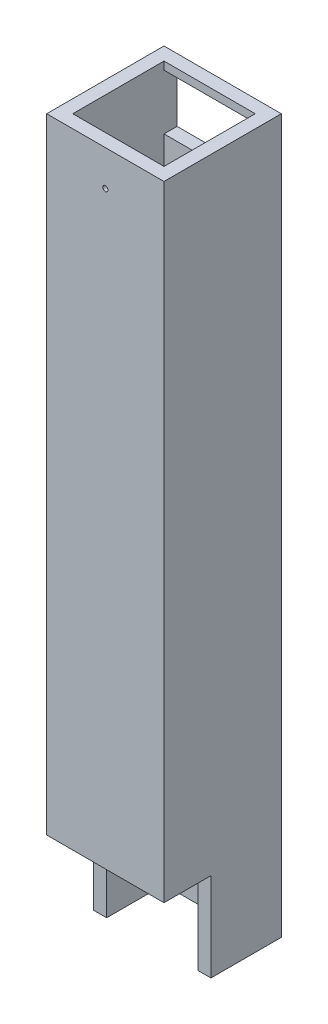
ISO-10303-21;
HEADER;
FILE_DESCRIPTION(('STEP AP214'),'2;1');
FILE_NAME('part.step','',(''),(''),'','','');
FILE_SCHEMA(('AUTOMOTIVE_DESIGN { 1 0 10303 214 1 1 1 1 }'));
ENDSEC;
DATA;
#1=APPLICATION_CONTEXT('core data for automotive mechanical design processes');
#2=APPLICATION_PROTOCOL_DEFINITION('international standard','automotive_design',2000,#1);
#3=PRODUCT_CONTEXT('',#1,'mechanical');
#4=PRODUCT('Part','Part','',(#3));
#5=PRODUCT_RELATED_PRODUCT_CATEGORY('part','',(#4));
#6=PRODUCT_DEFINITION_FORMATION('','',#4);
#7=PRODUCT_DEFINITION_CONTEXT('part definition',#1,'design');
#8=PRODUCT_DEFINITION('design','',#6,#7);
#9=PRODUCT_DEFINITION_SHAPE('','',#8);
#10=(LENGTH_UNIT() NAMED_UNIT(*) SI_UNIT(.MILLI.,.METRE.));
#11=(NAMED_UNIT(*) PLANE_ANGLE_UNIT() SI_UNIT($,.RADIAN.));
#12=(NAMED_UNIT(*) SI_UNIT($,.STERADIAN.) SOLID_ANGLE_UNIT());
#13=UNCERTAINTY_MEASURE_WITH_UNIT(LENGTH_MEASURE(1.E-05),#10,'distance_accuracy_value','');
#14=(GEOMETRIC_REPRESENTATION_CONTEXT(3) GLOBAL_UNCERTAINTY_ASSIGNED_CONTEXT((#13)) GLOBAL_UNIT_ASSIGNED_CONTEXT((#10,
#11,#12)) REPRESENTATION_CONTEXT('',''));
#15=CARTESIAN_POINT('',(0.,0.,0.));
#16=DIRECTION('',(0.,0.,1.));
#17=DIRECTION('',(1.,0.,0.));
#18=AXIS2_PLACEMENT_3D('',#15,#16,#17);
#19=CARTESIAN_POINT('',(-17.5,0.,-17.5));
#20=DIRECTION('',(0.,0.,1.));
#21=DIRECTION('',(1.,0.,0.));
#22=AXIS2_PLACEMENT_3D('',#19,#20,#21);
#23=PLANE('',#22);
#24=DIRECTION('',(1.,0.,0.));
#25=VECTOR('',#24,1.);
#26=CARTESIAN_POINT('',(-17.5,273.612120728358,-17.5));
#27=LINE('',#26,#25);
#28=CARTESIAN_POINT('',(-17.5,273.612120728358,-17.5));
#29=VERTEX_POINT('',#28);
#30=CARTESIAN_POINT('',(17.5,273.612120728358,-17.5));
#31=VERTEX_POINT('',#30);
#32=EDGE_CURVE('E198',#29,#31,#27,.T.);
#33=ORIENTED_EDGE('',*,*,#32,.F.);
#34=DIRECTION('',(0.,1.,0.));
#35=VECTOR('',#34,1.);
#36=CARTESIAN_POINT('',(-17.5,0.,-17.5));
#37=LINE('',#36,#35);
#38=CARTESIAN_POINT('',(-17.5,270.587205010945,-17.5));
#39=VERTEX_POINT('',#38);
#40=EDGE_CURVE('E240',#39,#29,#37,.T.);
#41=ORIENTED_EDGE('',*,*,#40,.F.);
#42=DIRECTION('',(1.,0.,0.));
#43=VECTOR('',#42,1.);
#44=CARTESIAN_POINT('',(-17.5,270.587205010945,-17.5));
#45=LINE('',#44,#43);
#46=CARTESIAN_POINT('',(17.5,270.587205010945,-17.5));
#47=VERTEX_POINT('',#46);
#48=EDGE_CURVE('E186',#39,#47,#45,.T.);
#49=ORIENTED_EDGE('',*,*,#48,.T.);
#50=DIRECTION('',(0.,1.,0.));
#51=VECTOR('',#50,1.);
#52=CARTESIAN_POINT('',(17.5,0.,-17.5));
#53=LINE('',#52,#51);
#54=EDGE_CURVE('E236',#47,#31,#53,.T.);
#55=ORIENTED_EDGE('',*,*,#54,.T.);
#56=EDGE_LOOP('',(#33,#41,#49,#55));
#57=FACE_BOUND('',#56,.T.);
#58=ADVANCED_FACE('F39',(#57),#23,.T.);
#59=CARTESIAN_POINT('',(0.,0.,0.));
#60=DIRECTION('',(0.,-1.,0.));
#61=DIRECTION('',(0.,0.,-1.));
#62=AXIS2_PLACEMENT_3D('',#59,#60,#61);
#63=PLANE('',#62);
#64=DIRECTION('',(1.,0.,0.));
#65=VECTOR('',#64,1.);
#66=CARTESIAN_POINT('',(-17.5,0.,-17.5));
#67=LINE('',#66,#65);
#68=CARTESIAN_POINT('',(-17.5,0.,-17.5));
#69=VERTEX_POINT('',#68);
#70=CARTESIAN_POINT('',(17.5,0.,-17.5));
#71=VERTEX_POINT('',#70);
#72=EDGE_CURVE('E225',#69,#71,#67,.T.);
#73=ORIENTED_EDGE('',*,*,#72,.F.);
#74=DIRECTION('',(0.,0.,-1.));
#75=VECTOR('',#74,1.);
#76=CARTESIAN_POINT('',(-17.5,0.,17.5));
#77=LINE('',#76,#75);
#78=CARTESIAN_POINT('',(-17.5,0.,4.5));
#79=VERTEX_POINT('',#78);
#80=EDGE_CURVE('E217',#79,#69,#77,.T.);
#81=ORIENTED_EDGE('',*,*,#80,.F.);
#82=DIRECTION('',(-1.,0.,0.));
#83=VECTOR('',#82,1.);
#84=CARTESIAN_POINT('',(22.5,0.,4.5));
#85=LINE('',#84,#83);
#86=CARTESIAN_POINT('',(-22.5,0.,4.50000000000001));
#87=VERTEX_POINT('',#86);
#88=EDGE_CURVE('E266',#79,#87,#85,.T.);
#89=ORIENTED_EDGE('',*,*,#88,.T.);
#90=DIRECTION('',(0.,0.,1.));
#91=VECTOR('',#90,1.);
#92=CARTESIAN_POINT('',(-22.5,0.,22.5));
#93=LINE('',#92,#91);
#94=CARTESIAN_POINT('',(-22.5,0.,-22.5));
#95=VERTEX_POINT('',#94);
#96=EDGE_CURVE('E276',#95,#87,#93,.T.);
#97=ORIENTED_EDGE('',*,*,#96,.F.);
#98=DIRECTION('',(-1.,0.,0.));
#99=VECTOR('',#98,1.);
#100=CARTESIAN_POINT('',(-22.5,0.,-22.5));
#101=LINE('',#100,#99);
#102=CARTESIAN_POINT('',(22.5,0.,-22.5));
#103=VERTEX_POINT('',#102);
#104=EDGE_CURVE('E169',#103,#95,#101,.T.);
#105=ORIENTED_EDGE('',*,*,#104,.F.);
#106=DIRECTION('',(0.,0.,-1.));
#107=VECTOR('',#106,1.);
#108=CARTESIAN_POINT('',(22.5,0.,22.5));
#109=LINE('',#108,#107);
#110=CARTESIAN_POINT('',(22.5,0.,4.5));
#111=VERTEX_POINT('',#110);
#112=EDGE_CURVE('E265',#111,#103,#109,.T.);
#113=ORIENTED_EDGE('',*,*,#112,.F.);
#114=CARTESIAN_POINT('',(17.5,0.,4.5));
#115=VERTEX_POINT('',#114);
#116=EDGE_CURVE('E262',#111,#115,#85,.T.);
#117=ORIENTED_EDGE('',*,*,#116,.T.);
#118=DIRECTION('',(0.,0.,-1.));
#119=VECTOR('',#118,1.);
#120=CARTESIAN_POINT('',(17.5,0.,17.5));
#121=LINE('',#120,#119);
#122=EDGE_CURVE('E227',#115,#71,#121,.T.);
#123=ORIENTED_EDGE('',*,*,#122,.T.);
#124=EDGE_LOOP('',(#73,#81,#89,#97,#105,#113,#117,#123));
#125=FACE_BOUND('',#124,.T.);
#126=ADVANCED_FACE('F321',(#125),#63,.T.);
#127=CARTESIAN_POINT('',(22.5,0.,4.5));
#128=DIRECTION('',(0.,0.,-1.));
#129=DIRECTION('',(-1.,0.,0.));
#130=AXIS2_PLACEMENT_3D('',#127,#128,#129);
#131=PLANE('',#130);
#132=DIRECTION('',(0.,-1.,0.));
#133=VECTOR('',#132,1.);
#134=CARTESIAN_POINT('',(-17.5,0.,4.5));
#135=LINE('',#134,#133);
#136=CARTESIAN_POINT('',(-17.5,34.,4.5));
#137=VERTEX_POINT('',#136);
#138=EDGE_CURVE('E247',#137,#79,#135,.T.);
#139=ORIENTED_EDGE('',*,*,#138,.F.);
#140=DIRECTION('',(-1.,0.,0.));
#141=VECTOR('',#140,1.);
#142=CARTESIAN_POINT('',(22.5,34.,4.5));
#143=LINE('',#142,#141);
#144=CARTESIAN_POINT('',(-22.5,34.,4.5));
#145=VERTEX_POINT('',#144);
#146=EDGE_CURVE('E270',#137,#145,#143,.T.);
#147=ORIENTED_EDGE('',*,*,#146,.T.);
#148=DIRECTION('',(0.,-1.,0.));
#149=VECTOR('',#148,1.);
#150=CARTESIAN_POINT('',(-22.5,0.,4.5));
#151=LINE('',#150,#149);
#152=EDGE_CURVE('E254',#145,#87,#151,.T.);
#153=ORIENTED_EDGE('',*,*,#152,.T.);
#154=ORIENTED_EDGE('',*,*,#88,.F.);
#155=EDGE_LOOP('',(#139,#147,#153,#154));
#156=FACE_BOUND('',#155,.T.);
#157=ADVANCED_FACE('F315',(#156),#131,.F.);
#158=CARTESIAN_POINT('',(22.5,34.,4.5));
#159=DIRECTION('',(0.,1.,0.));
#160=DIRECTION('',(0.,0.,1.));
#161=AXIS2_PLACEMENT_3D('',#158,#159,#160);
#162=PLANE('',#161);
#163=DIRECTION('',(0.,0.,-1.));
#164=VECTOR('',#163,1.);
#165=CARTESIAN_POINT('',(-17.5,34.,4.5));
#166=LINE('',#165,#164);
#167=CARTESIAN_POINT('',(-17.5,34.,17.5));
#168=VERTEX_POINT('',#167);
#169=EDGE_CURVE('E184',#168,#137,#166,.T.);
#170=ORIENTED_EDGE('',*,*,#169,.F.);
#171=DIRECTION('',(1.,0.,0.));
#172=VECTOR('',#171,1.);
#173=CARTESIAN_POINT('',(22.5,34.,17.5));
#174=LINE('',#173,#172);
#175=CARTESIAN_POINT('',(17.5,34.,17.5));
#176=VERTEX_POINT('',#175);
#177=EDGE_CURVE('E173',#168,#176,#174,.T.);
#178=ORIENTED_EDGE('',*,*,#177,.T.);
#179=DIRECTION('',(0.,0.,-1.));
#180=VECTOR('',#179,1.);
#181=CARTESIAN_POINT('',(17.5,34.,4.5));
#182=LINE('',#181,#180);
#183=CARTESIAN_POINT('',(17.5,34.,4.5));
#184=VERTEX_POINT('',#183);
#185=EDGE_CURVE('E181',#176,#184,#182,.T.);
#186=ORIENTED_EDGE('',*,*,#185,.T.);
#187=CARTESIAN_POINT('',(22.5,34.,4.5));
#188=VERTEX_POINT('',#187);
#189=EDGE_CURVE('E267',#188,#184,#143,.T.);
#190=ORIENTED_EDGE('',*,*,#189,.F.);
#191=DIRECTION('',(0.,0.,-1.));
#192=VECTOR('',#191,1.);
#193=CARTESIAN_POINT('',(22.5,34.,4.5));
#194=LINE('',#193,#192);
#195=CARTESIAN_POINT('',(22.5,34.,22.5));
#196=VERTEX_POINT('',#195);
#197=EDGE_CURVE('E250',#196,#188,#194,.T.);
#198=ORIENTED_EDGE('',*,*,#197,.F.);
#199=DIRECTION('',(-1.,0.,0.));
#200=VECTOR('',#199,1.);
#201=CARTESIAN_POINT('',(22.5,34.,22.5));
#202=LINE('',#201,#200);
#203=CARTESIAN_POINT('',(-22.5,34.,22.5));
#204=VERTEX_POINT('',#203);
#205=EDGE_CURVE('E257',#196,#204,#202,.T.);
#206=ORIENTED_EDGE('',*,*,#205,.T.);
#207=DIRECTION('',(0.,0.,-1.));
#208=VECTOR('',#207,1.);
#209=CARTESIAN_POINT('',(-22.5,34.,4.5));
#210=LINE('',#209,#208);
#211=EDGE_CURVE('E249',#204,#145,#210,.T.);
#212=ORIENTED_EDGE('',*,*,#211,.T.);
#213=ORIENTED_EDGE('',*,*,#146,.F.);
#214=EDGE_LOOP('',(#170,#178,#186,#190,#198,#206,#212,#213));
#215=FACE_BOUND('',#214,.T.);
#216=ADVANCED_FACE('F284',(#215),#162,.F.);
#217=CARTESIAN_POINT('',(22.5,300.,22.5));
#218=DIRECTION('',(-1.,0.,0.));
#219=DIRECTION('',(0.,0.,1.));
#220=AXIS2_PLACEMENT_3D('',#217,#218,#219);
#221=PLANE('',#220);
#222=DIRECTION('',(0.,-1.,0.));
#223=VECTOR('',#222,1.);
#224=CARTESIAN_POINT('',(22.5,300.,-22.5));
#225=LINE('',#224,#223);
#226=CARTESIAN_POINT('',(22.5,273.612120728358,-22.5));
#227=VERTEX_POINT('',#226);
#228=EDGE_CURVE('E171',#227,#103,#225,.T.);
#229=ORIENTED_EDGE('',*,*,#228,.F.);
#230=DIRECTION('',(0.,0.,1.));
#231=VECTOR('',#230,1.);
#232=CARTESIAN_POINT('',(22.5,273.612120728358,-22.5));
#233=LINE('',#232,#231);
#234=CARTESIAN_POINT('',(22.5,273.612120728358,22.5));
#235=VERTEX_POINT('',#234);
#236=EDGE_CURVE('E152',#227,#235,#233,.T.);
#237=ORIENTED_EDGE('',*,*,#236,.T.);
#238=DIRECTION('',(0.,-1.,0.));
#239=VECTOR('',#238,1.);
#240=CARTESIAN_POINT('',(22.5,300.,22.5));
#241=LINE('',#240,#239);
#242=EDGE_CURVE('E175',#235,#196,#241,.T.);
#243=ORIENTED_EDGE('',*,*,#242,.T.);
#244=ORIENTED_EDGE('',*,*,#197,.T.);
#245=DIRECTION('',(0.,-1.,0.));
#246=VECTOR('',#245,1.);
#247=CARTESIAN_POINT('',(22.5,0.,4.5));
#248=LINE('',#247,#246);
#249=EDGE_CURVE('E253',#188,#111,#248,.T.);
#250=ORIENTED_EDGE('',*,*,#249,.T.);
#251=ORIENTED_EDGE('',*,*,#112,.T.);
#252=EDGE_LOOP('',(#229,#237,#243,#244,#250,#251));
#253=FACE_BOUND('',#252,.T.);
#254=ADVANCED_FACE('F41',(#253),#221,.F.);
#255=CARTESIAN_POINT('',(-22.5,300.,-22.5));
#256=DIRECTION('',(0.,0.,1.));
#257=DIRECTION('',(1.,0.,0.));
#258=AXIS2_PLACEMENT_3D('',#255,#256,#257);
#259=PLANE('',#258);
#260=DIRECTION('',(0.,1.,0.));
#261=VECTOR('',#260,1.);
#262=CARTESIAN_POINT('',(-17.5,249.412794989055,-22.5));
#263=LINE('',#262,#261);
#264=CARTESIAN_POINT('',(-17.5,249.412794989055,-22.5));
#265=VERTEX_POINT('',#264);
#266=CARTESIAN_POINT('',(-17.5,270.587205010945,-22.5));
#267=VERTEX_POINT('',#266);
#268=EDGE_CURVE('E195',#265,#267,#263,.T.);
#269=ORIENTED_EDGE('',*,*,#268,.F.);
#270=DIRECTION('',(-1.,0.,0.));
#271=VECTOR('',#270,1.);
#272=CARTESIAN_POINT('',(17.5,249.412794989055,-22.5));
#273=LINE('',#272,#271);
#274=CARTESIAN_POINT('',(17.5,249.412794989055,-22.5));
#275=VERTEX_POINT('',#274);
#276=EDGE_CURVE('E191',#275,#265,#273,.T.);
#277=ORIENTED_EDGE('',*,*,#276,.F.);
#278=DIRECTION('',(0.,1.,0.));
#279=VECTOR('',#278,1.);
#280=CARTESIAN_POINT('',(17.5,249.412794989055,-22.5));
#281=LINE('',#280,#279);
#282=CARTESIAN_POINT('',(17.5,270.587205010945,-22.5));
#283=VERTEX_POINT('',#282);
#284=EDGE_CURVE('E211',#275,#283,#281,.T.);
#285=ORIENTED_EDGE('',*,*,#284,.T.);
#286=DIRECTION('',(-1.,0.,0.));
#287=VECTOR('',#286,1.);
#288=CARTESIAN_POINT('',(17.5,270.587205010945,-22.5));
#289=LINE('',#288,#287);
#290=EDGE_CURVE('E208',#283,#267,#289,.T.);
#291=ORIENTED_EDGE('',*,*,#290,.T.);
#292=EDGE_LOOP('',(#269,#277,#285,#291));
#293=FACE_BOUND('',#292,.T.);
#294=DIRECTION('',(0.,-1.,0.));
#295=VECTOR('',#294,1.);
#296=CARTESIAN_POINT('',(-22.5,300.,-22.5));
#297=LINE('',#296,#295);
#298=CARTESIAN_POINT('',(-22.5,273.612120728358,-22.5));
#299=VERTEX_POINT('',#298);
#300=EDGE_CURVE('E162',#299,#95,#297,.T.);
#301=ORIENTED_EDGE('',*,*,#300,.F.);
#302=DIRECTION('',(1.,0.,0.));
#303=VECTOR('',#302,1.);
#304=CARTESIAN_POINT('',(-22.5,273.612120728358,-22.5));
#305=LINE('',#304,#303);
#306=EDGE_CURVE('E149',#299,#227,#305,.T.);
#307=ORIENTED_EDGE('',*,*,#306,.T.);
#308=ORIENTED_EDGE('',*,*,#228,.T.);
#309=ORIENTED_EDGE('',*,*,#104,.T.);
#310=EDGE_LOOP('',(#301,#307,#308,#309));
#311=FACE_BOUND('',#310,.T.);
#312=ADVANCED_FACE('F167',(#293,#311),#259,.F.);
#313=CARTESIAN_POINT('',(-22.5,300.,22.5));
#314=DIRECTION('',(1.,0.,0.));
#315=DIRECTION('',(0.,0.,-1.));
#316=AXIS2_PLACEMENT_3D('',#313,#314,#315);
#317=PLANE('',#316);
#318=DIRECTION('',(0.,-1.,0.));
#319=VECTOR('',#318,1.);
#320=CARTESIAN_POINT('',(-22.5,300.,22.5));
#321=LINE('',#320,#319);
#322=CARTESIAN_POINT('',(-22.5,273.612120728358,22.5));
#323=VERTEX_POINT('',#322);
#324=EDGE_CURVE('E165',#323,#204,#321,.T.);
#325=ORIENTED_EDGE('',*,*,#324,.F.);
#326=DIRECTION('',(0.,0.,1.));
#327=VECTOR('',#326,1.);
#328=CARTESIAN_POINT('',(-22.5,273.612120728358,-22.5));
#329=LINE('',#328,#327);
#330=EDGE_CURVE('E54',#299,#323,#329,.T.);
#331=ORIENTED_EDGE('',*,*,#330,.F.);
#332=ORIENTED_EDGE('',*,*,#300,.T.);
#333=ORIENTED_EDGE('',*,*,#96,.T.);
#334=ORIENTED_EDGE('',*,*,#152,.F.);
#335=ORIENTED_EDGE('',*,*,#211,.F.);
#336=EDGE_LOOP('',(#325,#331,#332,#333,#334,#335));
#337=FACE_BOUND('',#336,.T.);
#338=ADVANCED_FACE('F160',(#337),#317,.F.);
#339=CARTESIAN_POINT('',(-22.5,300.,22.5));
#340=DIRECTION('',(0.,0.,-1.));
#341=DIRECTION('',(-1.,0.,0.));
#342=AXIS2_PLACEMENT_3D('',#339,#340,#341);
#343=PLANE('',#342);
#344=CARTESIAN_POINT('',(0.,260.,22.5));
#345=DIRECTION('',(0.,0.,1.));
#346=DIRECTION('',(1.,0.,0.));
#347=AXIS2_PLACEMENT_3D('',#344,#345,#346);
#348=CIRCLE('',#347,1.);
#349=CARTESIAN_POINT('',(1.,260.,22.5));
#350=VERTEX_POINT('',#349);
#351=EDGE_CURVE('E192',#350,#350,#348,.T.);
#352=ORIENTED_EDGE('',*,*,#351,.F.);
#353=EDGE_LOOP('',(#352));
#354=FACE_BOUND('',#353,.T.);
#355=ORIENTED_EDGE('',*,*,#242,.F.);
#356=DIRECTION('',(1.,0.,0.));
#357=VECTOR('',#356,1.);
#358=CARTESIAN_POINT('',(-22.5,273.612120728358,22.5));
#359=LINE('',#358,#357);
#360=EDGE_CURVE('E156',#323,#235,#359,.T.);
#361=ORIENTED_EDGE('',*,*,#360,.F.);
#362=ORIENTED_EDGE('',*,*,#324,.T.);
#363=ORIENTED_EDGE('',*,*,#205,.F.);
#364=EDGE_LOOP('',(#355,#361,#362,#363));
#365=FACE_BOUND('',#364,.T.);
#366=ADVANCED_FACE('F286',(#354,#365),#343,.F.);
#367=ORIENTED_EDGE('',*,*,#189,.T.);
#368=DIRECTION('',(0.,-1.,0.));
#369=VECTOR('',#368,1.);
#370=CARTESIAN_POINT('',(17.5,0.,4.5));
#371=LINE('',#370,#369);
#372=EDGE_CURVE('E244',#184,#115,#371,.T.);
#373=ORIENTED_EDGE('',*,*,#372,.T.);
#374=ORIENTED_EDGE('',*,*,#116,.F.);
#375=ORIENTED_EDGE('',*,*,#249,.F.);
#376=EDGE_LOOP('',(#367,#373,#374,#375));
#377=FACE_BOUND('',#376,.T.);
#378=ADVANCED_FACE('F390',(#377),#131,.F.);
#379=CARTESIAN_POINT('',(-17.5,0.,17.5));
#380=DIRECTION('',(1.,0.,0.));
#381=DIRECTION('',(0.,0.,-1.));
#382=AXIS2_PLACEMENT_3D('',#379,#380,#381);
#383=PLANE('',#382);
#384=DIRECTION('',(0.,0.,-1.));
#385=VECTOR('',#384,1.);
#386=CARTESIAN_POINT('',(-17.5,273.612120728358,17.5));
#387=LINE('',#386,#385);
#388=CARTESIAN_POINT('',(-17.5,273.612120728358,17.5));
#389=VERTEX_POINT('',#388);
#390=EDGE_CURVE('E202',#389,#29,#387,.T.);
#391=ORIENTED_EDGE('',*,*,#390,.F.);
#392=DIRECTION('',(0.,1.,0.));
#393=VECTOR('',#392,1.);
#394=CARTESIAN_POINT('',(-17.5,0.,17.5));
#395=LINE('',#394,#393);
#396=EDGE_CURVE('E230',#168,#389,#395,.T.);
#397=ORIENTED_EDGE('',*,*,#396,.F.);
#398=ORIENTED_EDGE('',*,*,#169,.T.);
#399=ORIENTED_EDGE('',*,*,#138,.T.);
#400=ORIENTED_EDGE('',*,*,#80,.T.);
#401=CARTESIAN_POINT('',(-17.5,249.412794989055,-17.5));
#402=VERTEX_POINT('',#401);
#403=EDGE_CURVE('E241',#69,#402,#37,.T.);
#404=ORIENTED_EDGE('',*,*,#403,.T.);
#405=DIRECTION('',(0.,0.,-1.));
#406=VECTOR('',#405,1.);
#407=CARTESIAN_POINT('',(-17.5,249.412794989055,-12.5));
#408=LINE('',#407,#406);
#409=EDGE_CURVE('E214',#402,#265,#408,.T.);
#410=ORIENTED_EDGE('',*,*,#409,.T.);
#411=ORIENTED_EDGE('',*,*,#268,.T.);
#412=DIRECTION('',(0.,0.,-1.));
#413=VECTOR('',#412,1.);
#414=CARTESIAN_POINT('',(-17.5,270.587205010945,-12.5));
#415=LINE('',#414,#413);
#416=EDGE_CURVE('E220',#39,#267,#415,.T.);
#417=ORIENTED_EDGE('',*,*,#416,.F.);
#418=ORIENTED_EDGE('',*,*,#40,.T.);
#419=EDGE_LOOP('',(#391,#397,#398,#399,#400,#404,#410,#411,#417,#418));
#420=FACE_BOUND('',#419,.T.);
#421=ADVANCED_FACE('F299',(#420),#383,.T.);
#422=CARTESIAN_POINT('',(17.5,0.,17.5));
#423=DIRECTION('',(1.,0.,0.));
#424=DIRECTION('',(0.,0.,-1.));
#425=AXIS2_PLACEMENT_3D('',#422,#423,#424);
#426=PLANE('',#425);
#427=DIRECTION('',(0.,1.,0.));
#428=VECTOR('',#427,1.);
#429=CARTESIAN_POINT('',(17.5,0.,17.5));
#430=LINE('',#429,#428);
#431=CARTESIAN_POINT('',(17.5,273.612120728358,17.5));
#432=VERTEX_POINT('',#431);
#433=EDGE_CURVE('E233',#176,#432,#430,.T.);
#434=ORIENTED_EDGE('',*,*,#433,.T.);
#435=DIRECTION('',(0.,0.,-1.));
#436=VECTOR('',#435,1.);
#437=CARTESIAN_POINT('',(17.5,273.612120728358,17.5));
#438=LINE('',#437,#436);
#439=EDGE_CURVE('E62',#432,#31,#438,.T.);
#440=ORIENTED_EDGE('',*,*,#439,.T.);
#441=ORIENTED_EDGE('',*,*,#54,.F.);
#442=DIRECTION('',(0.,0.,-1.));
#443=VECTOR('',#442,1.);
#444=CARTESIAN_POINT('',(17.5,270.587205010945,-12.5));
#445=LINE('',#444,#443);
#446=EDGE_CURVE('E218',#47,#283,#445,.T.);
#447=ORIENTED_EDGE('',*,*,#446,.T.);
#448=ORIENTED_EDGE('',*,*,#284,.F.);
#449=DIRECTION('',(0.,0.,-1.));
#450=VECTOR('',#449,1.);
#451=CARTESIAN_POINT('',(17.5,249.412794989055,-12.5));
#452=LINE('',#451,#450);
#453=CARTESIAN_POINT('',(17.5,249.412794989055,-17.5));
#454=VERTEX_POINT('',#453);
#455=EDGE_CURVE('E215',#454,#275,#452,.T.);
#456=ORIENTED_EDGE('',*,*,#455,.F.);
#457=EDGE_CURVE('E237',#71,#454,#53,.T.);
#458=ORIENTED_EDGE('',*,*,#457,.F.);
#459=ORIENTED_EDGE('',*,*,#122,.F.);
#460=ORIENTED_EDGE('',*,*,#372,.F.);
#461=ORIENTED_EDGE('',*,*,#185,.F.);
#462=EDGE_LOOP('',(#434,#440,#441,#447,#448,#456,#458,#459,#460,#461));
#463=FACE_BOUND('',#462,.T.);
#464=ADVANCED_FACE('F306',(#463),#426,.F.);
#465=CARTESIAN_POINT('',(-17.5,0.,17.5));
#466=DIRECTION('',(0.,0.,1.));
#467=DIRECTION('',(1.,0.,0.));
#468=AXIS2_PLACEMENT_3D('',#465,#466,#467);
#469=PLANE('',#468);
#470=CARTESIAN_POINT('',(0.,260.,17.5));
#471=DIRECTION('',(0.,0.,1.));
#472=DIRECTION('',(1.,0.,0.));
#473=AXIS2_PLACEMENT_3D('',#470,#471,#472);
#474=CIRCLE('',#473,1.);
#475=CARTESIAN_POINT('',(1.,260.,17.5));
#476=VERTEX_POINT('',#475);
#477=EDGE_CURVE('E189',#476,#476,#474,.T.);
#478=ORIENTED_EDGE('',*,*,#477,.T.);
#479=EDGE_LOOP('',(#478));
#480=FACE_BOUND('',#479,.T.);
#481=ORIENTED_EDGE('',*,*,#396,.T.);
#482=DIRECTION('',(1.,0.,0.));
#483=VECTOR('',#482,1.);
#484=CARTESIAN_POINT('',(-17.5,273.612120728358,17.5));
#485=LINE('',#484,#483);
#486=EDGE_CURVE('E11',#389,#432,#485,.T.);
#487=ORIENTED_EDGE('',*,*,#486,.T.);
#488=ORIENTED_EDGE('',*,*,#433,.F.);
#489=ORIENTED_EDGE('',*,*,#177,.F.);
#490=EDGE_LOOP('',(#481,#487,#488,#489));
#491=FACE_BOUND('',#490,.T.);
#492=ADVANCED_FACE('F310',(#480,#491),#469,.F.);
#493=DIRECTION('',(1.,0.,0.));
#494=VECTOR('',#493,1.);
#495=CARTESIAN_POINT('',(-17.5,249.412794989055,-17.5));
#496=LINE('',#495,#494);
#497=EDGE_CURVE('E47',#402,#454,#496,.T.);
#498=ORIENTED_EDGE('',*,*,#497,.F.);
#499=ORIENTED_EDGE('',*,*,#403,.F.);
#500=ORIENTED_EDGE('',*,*,#72,.T.);
#501=ORIENTED_EDGE('',*,*,#457,.T.);
#502=EDGE_LOOP('',(#498,#499,#500,#501));
#503=FACE_BOUND('',#502,.T.);
#504=ADVANCED_FACE('F325',(#503),#23,.T.);
#505=CARTESIAN_POINT('',(17.5,249.412794989055,-12.5));
#506=DIRECTION('',(0.,-1.,0.));
#507=DIRECTION('',(0.,0.,-1.));
#508=AXIS2_PLACEMENT_3D('',#505,#506,#507);
#509=PLANE('',#508);
#510=ORIENTED_EDGE('',*,*,#497,.T.);
#511=ORIENTED_EDGE('',*,*,#455,.T.);
#512=ORIENTED_EDGE('',*,*,#276,.T.);
#513=ORIENTED_EDGE('',*,*,#409,.F.);
#514=EDGE_LOOP('',(#510,#511,#512,#513));
#515=FACE_BOUND('',#514,.T.);
#516=ADVANCED_FACE('F329',(#515),#509,.F.);
#517=CARTESIAN_POINT('',(17.5,270.587205010945,-12.5));
#518=DIRECTION('',(0.,-1.,0.));
#519=DIRECTION('',(0.,0.,-1.));
#520=AXIS2_PLACEMENT_3D('',#517,#518,#519);
#521=PLANE('',#520);
#522=ORIENTED_EDGE('',*,*,#416,.T.);
#523=ORIENTED_EDGE('',*,*,#290,.F.);
#524=ORIENTED_EDGE('',*,*,#446,.F.);
#525=ORIENTED_EDGE('',*,*,#48,.F.);
#526=EDGE_LOOP('',(#522,#523,#524,#525));
#527=FACE_BOUND('',#526,.T.);
#528=ADVANCED_FACE('F304',(#527),#521,.T.);
#529=CARTESIAN_POINT('',(0.,260.,12.5));
#530=DIRECTION('',(0.,0.,1.));
#531=DIRECTION('',(1.,0.,0.));
#532=AXIS2_PLACEMENT_3D('',#529,#530,#531);
#533=CYLINDRICAL_SURFACE('',#532,1.);
#534=ORIENTED_EDGE('',*,*,#351,.T.);
#535=EDGE_LOOP('',(#534));
#536=FACE_BOUND('',#535,.T.);
#537=ORIENTED_EDGE('',*,*,#477,.F.);
#538=EDGE_LOOP('',(#537));
#539=FACE_BOUND('',#538,.T.);
#540=ADVANCED_FACE('F358',(#536,#539),#533,.F.);
#541=CARTESIAN_POINT('',(-22.5,273.612120728358,-22.5));
#542=DIRECTION('',(0.,-1.,0.));
#543=DIRECTION('',(0.,0.,-1.));
#544=AXIS2_PLACEMENT_3D('',#541,#542,#543);
#545=PLANE('',#544);
#546=ORIENTED_EDGE('',*,*,#32,.T.);
#547=ORIENTED_EDGE('',*,*,#439,.F.);
#548=ORIENTED_EDGE('',*,*,#486,.F.);
#549=ORIENTED_EDGE('',*,*,#390,.T.);
#550=EDGE_LOOP('',(#546,#547,#548,#549));
#551=FACE_BOUND('',#550,.T.);
#552=ORIENTED_EDGE('',*,*,#360,.T.);
#553=ORIENTED_EDGE('',*,*,#236,.F.);
#554=ORIENTED_EDGE('',*,*,#306,.F.);
#555=ORIENTED_EDGE('',*,*,#330,.T.);
#556=EDGE_LOOP('',(#552,#553,#554,#555));
#557=FACE_BOUND('',#556,.T.);
#558=ADVANCED_FACE('F150',(#551,#557),#545,.F.);
#559=CLOSED_SHELL('',(#58,#126,#157,#216,#254,#312,#338,#366,#378,#421,#464,#492,#504,#516,#528,
#540,#558));
#560=MANIFOLD_SOLID_BREP('B2',#559);
#561=ADVANCED_BREP_SHAPE_REPRESENTATION('',(#18,#560),#14);
#562=SHAPE_DEFINITION_REPRESENTATION(#9,#561);
ENDSEC;
END-ISO-10303-21;
